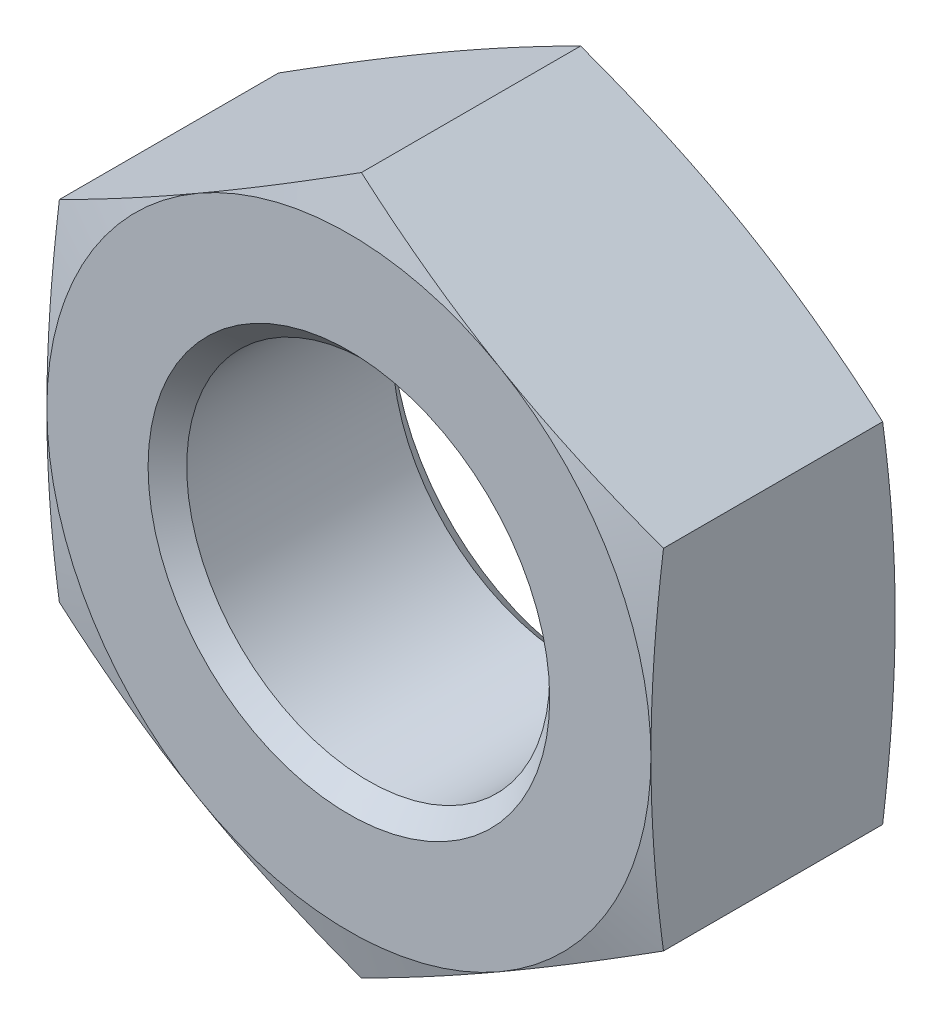
ISO-10303-21;
HEADER;
FILE_DESCRIPTION(('STEP AP214'),'2;1');
FILE_NAME('part.step','',(''),(''),'','','');
FILE_SCHEMA(('AUTOMOTIVE_DESIGN { 1 0 10303 214 1 1 1 1 }'));
ENDSEC;
DATA;
#1=APPLICATION_CONTEXT('core data for automotive mechanical design processes');
#2=APPLICATION_PROTOCOL_DEFINITION('international standard','automotive_design',2000,#1);
#3=PRODUCT_CONTEXT('',#1,'mechanical');
#4=PRODUCT('Part','Part','',(#3));
#5=PRODUCT_RELATED_PRODUCT_CATEGORY('part','',(#4));
#6=PRODUCT_DEFINITION_FORMATION('','',#4);
#7=PRODUCT_DEFINITION_CONTEXT('part definition',#1,'design');
#8=PRODUCT_DEFINITION('design','',#6,#7);
#9=PRODUCT_DEFINITION_SHAPE('','',#8);
#10=(LENGTH_UNIT() NAMED_UNIT(*) SI_UNIT(.MILLI.,.METRE.));
#11=(NAMED_UNIT(*) PLANE_ANGLE_UNIT() SI_UNIT($,.RADIAN.));
#12=(NAMED_UNIT(*) SI_UNIT($,.STERADIAN.) SOLID_ANGLE_UNIT());
#13=UNCERTAINTY_MEASURE_WITH_UNIT(LENGTH_MEASURE(1.E-05),#10,'distance_accuracy_value','');
#14=(GEOMETRIC_REPRESENTATION_CONTEXT(3) GLOBAL_UNCERTAINTY_ASSIGNED_CONTEXT((#13)) GLOBAL_UNIT_ASSIGNED_CONTEXT((#10,
#11,#12)) REPRESENTATION_CONTEXT('',''));
#15=CARTESIAN_POINT('',(0.,0.,0.));
#16=DIRECTION('',(0.,0.,1.));
#17=DIRECTION('',(1.,0.,0.));
#18=AXIS2_PLACEMENT_3D('',#15,#16,#17);
#19=CARTESIAN_POINT('',(0.,0.,0.));
#20=DIRECTION('',(0.,0.,-1.));
#21=DIRECTION('',(-1.,0.,0.));
#22=AXIS2_PLACEMENT_3D('',#19,#20,#21);
#23=PLANE('',#22);
#24=CARTESIAN_POINT('',(0.,0.,0.));
#25=DIRECTION('',(0.,0.,1.));
#26=DIRECTION('',(1.,0.,0.));
#27=AXIS2_PLACEMENT_3D('',#24,#25,#26);
#28=CIRCLE('',#27,11.938);
#29=CARTESIAN_POINT('',(11.938,0.,0.));
#30=VERTEX_POINT('',#29);
#31=CARTESIAN_POINT('',(5.96900000000041,10.3386112703787,0.));
#32=VERTEX_POINT('',#31);
#33=EDGE_CURVE('E11',#30,#32,#28,.T.);
#34=ORIENTED_EDGE('',*,*,#33,.T.);
#35=CARTESIAN_POINT('',(-5.96900000000041,10.3386112703787,0.));
#36=VERTEX_POINT('',#35);
#37=EDGE_CURVE('E43',#32,#36,#28,.T.);
#38=ORIENTED_EDGE('',*,*,#37,.T.);
#39=CARTESIAN_POINT('',(-11.938,0.,0.));
#40=VERTEX_POINT('',#39);
#41=EDGE_CURVE('E328',#36,#40,#28,.T.);
#42=ORIENTED_EDGE('',*,*,#41,.T.);
#43=CARTESIAN_POINT('',(-5.96900000000041,-10.3386112703787,0.));
#44=VERTEX_POINT('',#43);
#45=EDGE_CURVE('E321',#40,#44,#28,.T.);
#46=ORIENTED_EDGE('',*,*,#45,.T.);
#47=CARTESIAN_POINT('',(5.96900000000041,-10.3386112703787,0.));
#48=VERTEX_POINT('',#47);
#49=EDGE_CURVE('E324',#44,#48,#28,.T.);
#50=ORIENTED_EDGE('',*,*,#49,.T.);
#51=EDGE_CURVE('E44',#48,#30,#28,.T.);
#52=ORIENTED_EDGE('',*,*,#51,.T.);
#53=EDGE_LOOP('',(#34,#38,#42,#46,#50,#52));
#54=FACE_BOUND('',#53,.T.);
#55=CARTESIAN_POINT('',(0.,0.,0.));
#56=DIRECTION('',(0.,0.,1.));
#57=DIRECTION('',(1.,0.,0.));
#58=AXIS2_PLACEMENT_3D('',#55,#56,#57);
#59=CIRCLE('',#58,7.9375);
#60=CARTESIAN_POINT('',(7.9375,0.,0.));
#61=VERTEX_POINT('',#60);
#62=EDGE_CURVE('E185',#61,#61,#59,.T.);
#63=ORIENTED_EDGE('',*,*,#62,.F.);
#64=EDGE_LOOP('',(#63));
#65=FACE_BOUND('',#64,.T.);
#66=ADVANCED_FACE('F36',(#54,#65),#23,.F.);
#67=CARTESIAN_POINT('',(0.,11.938,-9.652));
#68=DIRECTION('',(0.,0.,1.));
#69=DIRECTION('',(1.,0.,0.));
#70=AXIS2_PLACEMENT_3D('',#67,#68,#69);
#71=PLANE('',#70);
#72=CARTESIAN_POINT('',(0.,0.,-9.652));
#73=DIRECTION('',(0.,0.,1.));
#74=DIRECTION('',(1.,0.,0.));
#75=AXIS2_PLACEMENT_3D('',#72,#73,#74);
#76=CIRCLE('',#75,11.938);
#77=CARTESIAN_POINT('',(11.938,0.,-9.652));
#78=VERTEX_POINT('',#77);
#79=CARTESIAN_POINT('',(5.96900000000041,10.3386112703787,-9.652));
#80=VERTEX_POINT('',#79);
#81=EDGE_CURVE('E359',#78,#80,#76,.T.);
#82=ORIENTED_EDGE('',*,*,#81,.F.);
#83=CARTESIAN_POINT('',(5.96900000000041,-10.3386112703787,-9.652));
#84=VERTEX_POINT('',#83);
#85=EDGE_CURVE('E362',#84,#78,#76,.T.);
#86=ORIENTED_EDGE('',*,*,#85,.F.);
#87=CARTESIAN_POINT('',(-5.96900000000041,-10.3386112703787,-9.652));
#88=VERTEX_POINT('',#87);
#89=EDGE_CURVE('E363',#88,#84,#76,.T.);
#90=ORIENTED_EDGE('',*,*,#89,.F.);
#91=CARTESIAN_POINT('',(-11.938,0.,-9.652));
#92=VERTEX_POINT('',#91);
#93=EDGE_CURVE('E143',#92,#88,#76,.T.);
#94=ORIENTED_EDGE('',*,*,#93,.F.);
#95=CARTESIAN_POINT('',(-5.96900000000041,10.3386112703787,-9.652));
#96=VERTEX_POINT('',#95);
#97=EDGE_CURVE('E360',#96,#92,#76,.T.);
#98=ORIENTED_EDGE('',*,*,#97,.F.);
#99=EDGE_CURVE('E356',#80,#96,#76,.T.);
#100=ORIENTED_EDGE('',*,*,#99,.F.);
#101=EDGE_LOOP('',(#82,#86,#90,#94,#98,#100));
#102=FACE_BOUND('',#101,.T.);
#103=CARTESIAN_POINT('',(0.,0.,-9.652));
#104=DIRECTION('',(0.,0.,1.));
#105=DIRECTION('',(1.,0.,0.));
#106=AXIS2_PLACEMENT_3D('',#103,#104,#105);
#107=CIRCLE('',#106,7.9375);
#108=CARTESIAN_POINT('',(7.9375,0.,-9.652));
#109=VERTEX_POINT('',#108);
#110=EDGE_CURVE('E205',#109,#109,#107,.T.);
#111=ORIENTED_EDGE('',*,*,#110,.T.);
#112=EDGE_LOOP('',(#111));
#113=FACE_BOUND('',#112,.T.);
#114=ADVANCED_FACE('F209',(#102,#113),#71,.F.);
#115=CARTESIAN_POINT('',(0.,0.,-0.63975549184855));
#116=DIRECTION('',(0.,0.,-1.));
#117=DIRECTION('',(-1.,0.,0.));
#118=AXIS2_PLACEMENT_3D('',#115,#116,#117);
#119=CONICAL_SURFACE('',#118,14.3256,1.30899693899575);
#120=CARTESIAN_POINT('',(-11.9382,6.89229204353196,-0.494883535596708));
#121=CARTESIAN_POINT('',(-11.4424282503734,7.17852599663549,-0.418156428695628));
#122=CARTESIAN_POINT('',(-10.9457576324378,7.46527891159921,-0.348500973257632));
#123=CARTESIAN_POINT('',(-9.95066243157995,8.03979739368385,-0.226122985982727));
#124=CARTESIAN_POINT('',(-9.45223721913185,8.32756332426167,-0.173407331405743));
#125=CARTESIAN_POINT('',(-8.45665466565767,8.90236317951052,-0.087986345206741));
#126=CARTESIAN_POINT('',(-7.9595040562106,9.18939321770259,-0.0551791492139855));
#127=CARTESIAN_POINT('',(-6.96456887030814,9.76381931510964,-0.0111880682381305));
#128=CARTESIAN_POINT('',(-6.46678443515407,10.0512152927443,0.));
#129=CARTESIAN_POINT('',(-5.47121556484592,10.6260072480135,0.));
#130=CARTESIAN_POINT('',(-4.97343112969185,10.9134032256482,-0.0111880682381549));
#131=CARTESIAN_POINT('',(-3.97849594378939,11.4878293230552,-0.0551791492140338));
#132=CARTESIAN_POINT('',(-3.48134533434232,11.7748593612473,-0.087986345206801));
#133=CARTESIAN_POINT('',(-2.48576278086814,12.3496592164961,-0.173407331405825));
#134=CARTESIAN_POINT('',(-1.98733756842005,12.637425147074,-0.226122985982818));
#135=CARTESIAN_POINT('',(-0.992242367562172,13.2119436291586,-0.348500973257741));
#136=CARTESIAN_POINT('',(-0.495571749626556,13.4986965441223,-0.418156428695746));
#137=CARTESIAN_POINT('',(0.000199999999999873,13.7849304972258,-0.494883535596833));
#138=B_SPLINE_CURVE_WITH_KNOTS('',3,(#120,#121,#122,#123,#124,#125,#126,#127,#128,#129,#130,
#131,#132,#133,#134,#135,#136,#137),.UNSPECIFIED.,.F.,.F.,(4,2,2,2,2,2,2,2,4),(0.,
1.73285128625863,3.46640519332185,5.19101265399724,6.91528637338862,8.63956009277999,
10.3641675534554,12.0977214605186,13.8305727467772),.UNSPECIFIED.);
#139=CARTESIAN_POINT('',(-11.938,6.8924075135858,-0.494852595100275));
#140=VERTEX_POINT('',#139);
#141=EDGE_CURVE('E336',#140,#36,#138,.T.);
#142=ORIENTED_EDGE('',*,*,#141,.F.);
#143=CARTESIAN_POINT('',(-11.938,-18.2329624239488,-2.64077400679266));
#144=CARTESIAN_POINT('',(-11.938,-17.6913696744449,-2.51939633949655));
#145=CARTESIAN_POINT('',(-11.938,-17.1494381756858,-2.39950312660577));
#146=CARTESIAN_POINT('',(-11.938,-16.0647313152317,-2.16348688179615));
#147=CARTESIAN_POINT('',(-11.938,-15.5219559181492,-2.04736401270748));
#148=CARTESIAN_POINT('',(-11.938,-14.434908682187,-1.81958867359742));
#149=CARTESIAN_POINT('',(-11.938,-13.890635897666,-1.70794070054803));
#150=CARTESIAN_POINT('',(-11.938,-12.8009574769211,-1.49032027214938));
#151=CARTESIAN_POINT('',(-11.938,-12.2555518502985,-1.38434776889991));
#152=CARTESIAN_POINT('',(-11.938,-11.1677674045129,-1.180247795952));
#153=CARTESIAN_POINT('',(-11.938,-10.6253991053055,-1.08206453394043));
#154=CARTESIAN_POINT('',(-11.938,-9.53916914199247,-0.894267340335431));
#155=CARTESIAN_POINT('',(-11.938,-8.99530747234857,-0.804653440566647));
#156=CARTESIAN_POINT('',(-11.938,-7.90600608674276,-0.636016702342263));
#157=CARTESIAN_POINT('',(-11.938,-7.36056659561774,-0.556992424159846));
#158=CARTESIAN_POINT('',(-11.938,-6.26795191717734,-0.41186228925882));
#159=CARTESIAN_POINT('',(-11.938,-5.72077672823634,-0.345756444642916));
#160=CARTESIAN_POINT('',(-11.938,-4.61851750236025,-0.22833505716445));
#161=CARTESIAN_POINT('',(-11.938,-4.06341433526461,-0.177196428128624));
#162=CARTESIAN_POINT('',(-11.938,-2.95181246319246,-0.093237299613816));
#163=CARTESIAN_POINT('',(-11.938,-2.39531379051455,-0.0604163800361554));
#164=CARTESIAN_POINT('',(-11.938,-1.28172815967689,-0.0150069189123938));
#165=CARTESIAN_POINT('',(-11.938,-0.724641584147543,-0.00240918301811301));
#166=CARTESIAN_POINT('',(-11.938,0.389611681402445,0.00177937722295485));
#167=CARTESIAN_POINT('',(-11.938,0.946778371353608,-0.00662978032144065));
#168=CARTESIAN_POINT('',(-11.938,2.06243645780666,-0.043982106061553));
#169=CARTESIAN_POINT('',(-11.938,2.62092530818588,-0.0729998002341817));
#170=CARTESIAN_POINT('',(-11.938,3.73658957414119,-0.149912821281346));
#171=CARTESIAN_POINT('',(-11.938,4.29376496036378,-0.197808566096605));
#172=CARTESIAN_POINT('',(-11.938,5.40679760797117,-0.310058338560213));
#173=CARTESIAN_POINT('',(-11.938,5.96265376929824,-0.374423106966597));
#174=CARTESIAN_POINT('',(-11.938,7.07257721361171,-0.516932618400637));
#175=CARTESIAN_POINT('',(-11.938,7.6266444909761,-0.595077404692646));
#176=CARTESIAN_POINT('',(-11.938,8.69641690113728,-0.757099427124152));
#177=CARTESIAN_POINT('',(-11.938,9.2122325547304,-0.840254303029304));
#178=CARTESIAN_POINT('',(-11.938,10.2425044503579,-1.01463514239579));
#179=CARTESIAN_POINT('',(-11.938,10.756960654909,-1.10586132605987));
#180=CARTESIAN_POINT('',(-11.938,11.7847069043095,-1.294911442235));
#181=CARTESIAN_POINT('',(-11.938,12.2979968264722,-1.39273603840907));
#182=CARTESIAN_POINT('',(-11.938,13.3235130283692,-1.59376697507529));
#183=CARTESIAN_POINT('',(-11.938,13.8357393176846,-1.69697326686994));
#184=CARTESIAN_POINT('',(-11.938,14.8594024070828,-1.90782005277345));
#185=CARTESIAN_POINT('',(-11.938,15.3708389914757,-2.01546159118339));
#186=CARTESIAN_POINT('',(-11.938,16.3929337232113,-2.23438433972006));
#187=CARTESIAN_POINT('',(-11.938,16.9035918660093,-2.34566557101054));
#188=CARTESIAN_POINT('',(-11.938,18.4345039483056,-2.68398646998532));
#189=CARTESIAN_POINT('',(-11.938,19.4537648727735,-2.91551781315897));
#190=CARTESIAN_POINT('',(-11.938,21.4803337058259,-3.38462009781527));
#191=CARTESIAN_POINT('',(-11.938,22.4876606512493,-3.62210933510761));
#192=CARTESIAN_POINT('',(-11.938,24.5009106019141,-4.10303560183728));
#193=CARTESIAN_POINT('',(-11.938,25.5068335812256,-4.34647273962938));
#194=CARTESIAN_POINT('',(-11.938,27.5163606552524,-4.83744827983636));
#195=CARTESIAN_POINT('',(-11.938,28.5199660796916,-5.08498125046663));
#196=CARTESIAN_POINT('',(-11.938,30.0247344667876,-5.45878236337262));
#197=CARTESIAN_POINT('',(-11.938,30.5262092376269,-5.58379764478769));
#198=CARTESIAN_POINT('',(-11.938,31.5289734668439,-5.83456702953237));
#199=CARTESIAN_POINT('',(-11.938,32.0302629254207,-5.96032113206533));
#200=CARTESIAN_POINT('',(-11.938,32.531471539357,-6.08639660660485));
#201=B_SPLINE_CURVE_WITH_KNOTS('',3,(#143,#144,#145,#146,#147,#148,#149,#150,#151,#152,#153,
#154,#155,#156,#157,#158,#159,#160,#161,#162,#163,#164,#165,#166,#167,#168,#169,#170,#171,#172,
#173,#174,#175,#176,#177,#178,#179,#180,#181,#182,#183,#184,#185,#186,#187,#188,#189,#190,#191,
#192,#193,#194,#195,#196,#197,#198,#199,#200),.UNSPECIFIED.,.F.,.F.,(4,2,2,2,2,2,2,2,2,2,2,2,2,
2,2,2,2,2,2,2,2,2,2,2,2,2,2,2,4),(0.,1.66508851645697,3.33024884784672,4.9970426158881,
6.66382231419357,8.31731808575057,9.97081999777277,11.6240968770559,13.2773753052131,
14.9494720185747,16.6215303824642,18.2928283396122,19.9641248560321,21.6414962055085,
23.3189046923561,24.9974099513293,26.6759204803055,28.243271107013,29.81066450763,
31.378215791163,32.9457528928094,34.5136612119763,36.0815786496928,39.2172010652111,
42.3220114684657,45.4268784752617,48.5279139911852,50.0783818372318,51.6288480117816),.UNSPECIFIED.);
#202=EDGE_CURVE('E154',#40,#140,#201,.T.);
#203=ORIENTED_EDGE('',*,*,#202,.F.);
#204=ORIENTED_EDGE('',*,*,#41,.F.);
#205=EDGE_LOOP('',(#142,#203,#204));
#206=FACE_BOUND('',#205,.T.);
#207=ADVANCED_FACE('F227',(#206),#119,.T.);
#208=CARTESIAN_POINT('',(0.,13.784815027172,-0.494852595100401));
#209=VERTEX_POINT('',#208);
#210=EDGE_CURVE('E333',#36,#209,#138,.T.);
#211=ORIENTED_EDGE('',*,*,#210,.F.);
#212=ORIENTED_EDGE('',*,*,#37,.F.);
#213=CARTESIAN_POINT('',(-0.0002,13.7849304972258,-0.494883535596833));
#214=CARTESIAN_POINT('',(0.495571749626556,13.4986965441223,-0.418156428695746));
#215=CARTESIAN_POINT('',(0.992242367562172,13.2119436291586,-0.348500973257741));
#216=CARTESIAN_POINT('',(1.98733756842005,12.637425147074,-0.226122985982818));
#217=CARTESIAN_POINT('',(2.48576278086814,12.3496592164961,-0.173407331405825));
#218=CARTESIAN_POINT('',(3.48134533434232,11.7748593612473,-0.0879863452068009));
#219=CARTESIAN_POINT('',(3.97849594378939,11.4878293230552,-0.0551791492140337));
#220=CARTESIAN_POINT('',(4.97343112969185,10.9134032256482,-0.0111880682381548));
#221=CARTESIAN_POINT('',(5.47121556484592,10.6260072480135,0.));
#222=CARTESIAN_POINT('',(6.46678443515407,10.0512152927443,0.));
#223=CARTESIAN_POINT('',(6.96456887030814,9.76381931510964,-0.0111880682381303));
#224=CARTESIAN_POINT('',(7.9595040562106,9.1893932177026,-0.0551791492139853));
#225=CARTESIAN_POINT('',(8.45665466565767,8.90236317951052,-0.087986345206741));
#226=CARTESIAN_POINT('',(9.45223721913186,8.32756332426167,-0.173407331405743));
#227=CARTESIAN_POINT('',(9.95066243157995,8.03979739368385,-0.226122985982727));
#228=CARTESIAN_POINT('',(10.9457576324378,7.46527891159921,-0.348500973257631));
#229=CARTESIAN_POINT('',(11.4424282503734,7.17852599663549,-0.418156428695627));
#230=CARTESIAN_POINT('',(11.9382,6.89229204353196,-0.494883535596707));
#231=B_SPLINE_CURVE_WITH_KNOTS('',3,(#213,#214,#215,#216,#217,#218,#219,#220,#221,#222,#223,
#224,#225,#226,#227,#228,#229,#230),.UNSPECIFIED.,.F.,.F.,(4,2,2,2,2,2,2,2,4),(0.,
1.73285128625862,3.46640519332184,5.19101265399724,6.91528637338861,8.63956009277998,
10.3641675534554,12.0977214605186,13.8305727467772),.UNSPECIFIED.);
#232=EDGE_CURVE('E266',#209,#32,#231,.T.);
#233=ORIENTED_EDGE('',*,*,#232,.F.);
#234=EDGE_LOOP('',(#211,#212,#233));
#235=FACE_BOUND('',#234,.T.);
#236=ADVANCED_FACE('F275',(#235),#119,.T.);
#237=CARTESIAN_POINT('',(11.938,6.8924075135858,-0.494852595100275));
#238=VERTEX_POINT('',#237);
#239=EDGE_CURVE('E261',#32,#238,#231,.T.);
#240=ORIENTED_EDGE('',*,*,#239,.F.);
#241=ORIENTED_EDGE('',*,*,#33,.F.);
#242=CARTESIAN_POINT('',(11.938,-18.2329624239488,-2.64077400679266));
#243=CARTESIAN_POINT('',(11.938,-17.6913696744449,-2.51939633949655));
#244=CARTESIAN_POINT('',(11.938,-17.1494381756858,-2.39950312660577));
#245=CARTESIAN_POINT('',(11.938,-16.0647313152317,-2.16348688179615));
#246=CARTESIAN_POINT('',(11.938,-15.5219559181492,-2.04736401270748));
#247=CARTESIAN_POINT('',(11.938,-14.434908682187,-1.81958867359742));
#248=CARTESIAN_POINT('',(11.938,-13.890635897666,-1.70794070054803));
#249=CARTESIAN_POINT('',(11.938,-12.8009574769211,-1.49032027214938));
#250=CARTESIAN_POINT('',(11.938,-12.2555518502985,-1.38434776889991));
#251=CARTESIAN_POINT('',(11.938,-11.1677674045129,-1.180247795952));
#252=CARTESIAN_POINT('',(11.938,-10.6253991053055,-1.08206453394043));
#253=CARTESIAN_POINT('',(11.938,-9.53916914199247,-0.894267340335431));
#254=CARTESIAN_POINT('',(11.938,-8.99530747234857,-0.804653440566647));
#255=CARTESIAN_POINT('',(11.938,-7.90600608674276,-0.636016702342263));
#256=CARTESIAN_POINT('',(11.938,-7.36056659561774,-0.556992424159846));
#257=CARTESIAN_POINT('',(11.938,-6.26795191717734,-0.41186228925882));
#258=CARTESIAN_POINT('',(11.938,-5.72077672823634,-0.345756444642916));
#259=CARTESIAN_POINT('',(11.938,-4.61851750236025,-0.22833505716445));
#260=CARTESIAN_POINT('',(11.938,-4.06341433526461,-0.177196428128624));
#261=CARTESIAN_POINT('',(11.938,-2.95181246319246,-0.093237299613816));
#262=CARTESIAN_POINT('',(11.938,-2.39531379051455,-0.0604163800361554));
#263=CARTESIAN_POINT('',(11.938,-1.28172815967689,-0.0150069189123938));
#264=CARTESIAN_POINT('',(11.938,-0.724641584147543,-0.00240918301811301));
#265=CARTESIAN_POINT('',(11.938,0.389611681402445,0.00177937722295485));
#266=CARTESIAN_POINT('',(11.938,0.946778371353608,-0.00662978032144065));
#267=CARTESIAN_POINT('',(11.938,2.06243645780666,-0.043982106061553));
#268=CARTESIAN_POINT('',(11.938,2.62092530818588,-0.0729998002341817));
#269=CARTESIAN_POINT('',(11.938,3.73658957414119,-0.149912821281346));
#270=CARTESIAN_POINT('',(11.938,4.29376496036378,-0.197808566096605));
#271=CARTESIAN_POINT('',(11.938,5.40679760797117,-0.310058338560213));
#272=CARTESIAN_POINT('',(11.938,5.96265376929824,-0.374423106966597));
#273=CARTESIAN_POINT('',(11.938,7.07257721361171,-0.516932618400637));
#274=CARTESIAN_POINT('',(11.938,7.6266444909761,-0.595077404692646));
#275=CARTESIAN_POINT('',(11.938,8.69641690113728,-0.757099427124152));
#276=CARTESIAN_POINT('',(11.938,9.2122325547304,-0.840254303029304));
#277=CARTESIAN_POINT('',(11.938,10.2425044503579,-1.01463514239579));
#278=CARTESIAN_POINT('',(11.938,10.756960654909,-1.10586132605987));
#279=CARTESIAN_POINT('',(11.938,11.7847069043095,-1.294911442235));
#280=CARTESIAN_POINT('',(11.938,12.2979968264722,-1.39273603840907));
#281=CARTESIAN_POINT('',(11.938,13.3235130283692,-1.59376697507529));
#282=CARTESIAN_POINT('',(11.938,13.8357393176846,-1.69697326686994));
#283=CARTESIAN_POINT('',(11.938,14.8594024070828,-1.90782005277345));
#284=CARTESIAN_POINT('',(11.938,15.3708389914757,-2.01546159118339));
#285=CARTESIAN_POINT('',(11.938,16.3929337232113,-2.23438433972006));
#286=CARTESIAN_POINT('',(11.938,16.9035918660093,-2.34566557101054));
#287=CARTESIAN_POINT('',(11.938,18.4345039483056,-2.68398646998532));
#288=CARTESIAN_POINT('',(11.938,19.4537648727735,-2.91551781315897));
#289=CARTESIAN_POINT('',(11.938,21.4803337058259,-3.38462009781527));
#290=CARTESIAN_POINT('',(11.938,22.4876606512493,-3.62210933510761));
#291=CARTESIAN_POINT('',(11.938,24.5009106019141,-4.10303560183728));
#292=CARTESIAN_POINT('',(11.938,25.5068335812256,-4.34647273962938));
#293=CARTESIAN_POINT('',(11.938,27.5163606552524,-4.83744827983636));
#294=CARTESIAN_POINT('',(11.938,28.5199660796916,-5.08498125046663));
#295=CARTESIAN_POINT('',(11.938,30.0247344667876,-5.45878236337262));
#296=CARTESIAN_POINT('',(11.938,30.5262092376269,-5.58379764478769));
#297=CARTESIAN_POINT('',(11.938,31.5289734668439,-5.83456702953237));
#298=CARTESIAN_POINT('',(11.938,32.0302629254207,-5.96032113206533));
#299=CARTESIAN_POINT('',(11.938,32.531471539357,-6.08639660660485));
#300=B_SPLINE_CURVE_WITH_KNOTS('',3,(#242,#243,#244,#245,#246,#247,#248,#249,#250,#251,#252,
#253,#254,#255,#256,#257,#258,#259,#260,#261,#262,#263,#264,#265,#266,#267,#268,#269,#270,#271,
#272,#273,#274,#275,#276,#277,#278,#279,#280,#281,#282,#283,#284,#285,#286,#287,#288,#289,#290,
#291,#292,#293,#294,#295,#296,#297,#298,#299),.UNSPECIFIED.,.F.,.F.,(4,2,2,2,2,2,2,2,2,2,2,2,2,
2,2,2,2,2,2,2,2,2,2,2,2,2,2,2,4),(0.,1.66508851645697,3.33024884784672,4.9970426158881,
6.66382231419357,8.31731808575057,9.97081999777277,11.6240968770559,13.2773753052131,
14.9494720185747,16.6215303824642,18.2928283396122,19.9641248560321,21.6414962055085,
23.3189046923561,24.9974099513293,26.6759204803055,28.243271107013,29.81066450763,
31.378215791163,32.9457528928094,34.5136612119763,36.0815786496928,39.2172010652111,
42.3220114684657,45.4268784752617,48.5279139911852,50.0783818372318,51.6288480117816),.UNSPECIFIED.);
#301=EDGE_CURVE('E293',#238,#30,#300,.F.);
#302=ORIENTED_EDGE('',*,*,#301,.F.);
#303=EDGE_LOOP('',(#240,#241,#302));
#304=FACE_BOUND('',#303,.T.);
#305=ADVANCED_FACE('F347',(#304),#119,.T.);
#306=CARTESIAN_POINT('',(11.938,-6.8924075135858,-0.494852595100275));
#307=VERTEX_POINT('',#306);
#308=EDGE_CURVE('E289',#30,#307,#300,.F.);
#309=ORIENTED_EDGE('',*,*,#308,.F.);
#310=ORIENTED_EDGE('',*,*,#51,.F.);
#311=CARTESIAN_POINT('',(11.9382,-6.89229204353196,-0.494883535596708));
#312=CARTESIAN_POINT('',(11.4424282503734,-7.17852599663549,-0.418156428695628));
#313=CARTESIAN_POINT('',(10.9457576324378,-7.46527891159921,-0.348500973257632));
#314=CARTESIAN_POINT('',(9.95066243157995,-8.03979739368385,-0.226122985982727));
#315=CARTESIAN_POINT('',(9.45223721913185,-8.32756332426167,-0.173407331405743));
#316=CARTESIAN_POINT('',(8.45665466565767,-8.90236317951052,-0.087986345206741));
#317=CARTESIAN_POINT('',(7.9595040562106,-9.18939321770259,-0.0551791492139855));
#318=CARTESIAN_POINT('',(6.96456887030814,-9.76381931510964,-0.0111880682381305));
#319=CARTESIAN_POINT('',(6.46678443515407,-10.0512152927443,0.));
#320=CARTESIAN_POINT('',(5.47121556484592,-10.6260072480135,0.));
#321=CARTESIAN_POINT('',(4.97343112969185,-10.9134032256482,-0.0111880682381549));
#322=CARTESIAN_POINT('',(3.97849594378939,-11.4878293230552,-0.0551791492140338));
#323=CARTESIAN_POINT('',(3.48134533434232,-11.7748593612473,-0.087986345206801));
#324=CARTESIAN_POINT('',(2.48576278086814,-12.3496592164961,-0.173407331405825));
#325=CARTESIAN_POINT('',(1.98733756842005,-12.637425147074,-0.226122985982818));
#326=CARTESIAN_POINT('',(0.992242367562172,-13.2119436291586,-0.348500973257741));
#327=CARTESIAN_POINT('',(0.495571749626556,-13.4986965441223,-0.418156428695746));
#328=CARTESIAN_POINT('',(-0.000199999999999873,-13.7849304972258,-0.494883535596833));
#329=B_SPLINE_CURVE_WITH_KNOTS('',3,(#311,#312,#313,#314,#315,#316,#317,#318,#319,#320,#321,
#322,#323,#324,#325,#326,#327,#328),.UNSPECIFIED.,.F.,.F.,(4,2,2,2,2,2,2,2,4),(0.,
1.73285128625863,3.46640519332185,5.19101265399724,6.91528637338862,8.63956009277999,
10.3641675534554,12.0977214605186,13.8305727467772),.UNSPECIFIED.);
#330=EDGE_CURVE('E299',#307,#48,#329,.T.);
#331=ORIENTED_EDGE('',*,*,#330,.F.);
#332=EDGE_LOOP('',(#309,#310,#331));
#333=FACE_BOUND('',#332,.T.);
#334=ADVANCED_FACE('F387',(#333),#119,.T.);
#335=CARTESIAN_POINT('',(0.,-13.784815027172,-0.494852595100401));
#336=VERTEX_POINT('',#335);
#337=EDGE_CURVE('E284',#48,#336,#329,.T.);
#338=ORIENTED_EDGE('',*,*,#337,.F.);
#339=ORIENTED_EDGE('',*,*,#49,.F.);
#340=CARTESIAN_POINT('',(0.0002,-13.7849304972258,-0.494883535596833));
#341=CARTESIAN_POINT('',(-0.495571749626556,-13.4986965441223,-0.418156428695746));
#342=CARTESIAN_POINT('',(-0.992242367562172,-13.2119436291586,-0.348500973257741));
#343=CARTESIAN_POINT('',(-1.98733756842005,-12.637425147074,-0.226122985982818));
#344=CARTESIAN_POINT('',(-2.48576278086814,-12.3496592164961,-0.173407331405825));
#345=CARTESIAN_POINT('',(-3.48134533434232,-11.7748593612473,-0.0879863452068009));
#346=CARTESIAN_POINT('',(-3.97849594378939,-11.4878293230552,-0.0551791492140337));
#347=CARTESIAN_POINT('',(-4.97343112969185,-10.9134032256482,-0.0111880682381548));
#348=CARTESIAN_POINT('',(-5.47121556484592,-10.6260072480135,0.));
#349=CARTESIAN_POINT('',(-6.46678443515407,-10.0512152927443,0.));
#350=CARTESIAN_POINT('',(-6.96456887030814,-9.76381931510964,-0.0111880682381303));
#351=CARTESIAN_POINT('',(-7.9595040562106,-9.1893932177026,-0.0551791492139853));
#352=CARTESIAN_POINT('',(-8.45665466565767,-8.90236317951052,-0.087986345206741));
#353=CARTESIAN_POINT('',(-9.45223721913186,-8.32756332426167,-0.173407331405743));
#354=CARTESIAN_POINT('',(-9.95066243157995,-8.03979739368385,-0.226122985982727));
#355=CARTESIAN_POINT('',(-10.9457576324378,-7.46527891159921,-0.348500973257631));
#356=CARTESIAN_POINT('',(-11.4424282503734,-7.17852599663549,-0.418156428695627));
#357=CARTESIAN_POINT('',(-11.9382,-6.89229204353196,-0.494883535596707));
#358=B_SPLINE_CURVE_WITH_KNOTS('',3,(#340,#341,#342,#343,#344,#345,#346,#347,#348,#349,#350,
#351,#352,#353,#354,#355,#356,#357),.UNSPECIFIED.,.F.,.F.,(4,2,2,2,2,2,2,2,4),(0.,
1.73285128625862,3.46640519332184,5.19101265399724,6.91528637338861,8.63956009277998,
10.3641675534554,12.0977214605186,13.8305727467772),.UNSPECIFIED.);
#359=EDGE_CURVE('E146',#336,#44,#358,.T.);
#360=ORIENTED_EDGE('',*,*,#359,.F.);
#361=EDGE_LOOP('',(#338,#339,#360));
#362=FACE_BOUND('',#361,.T.);
#363=ADVANCED_FACE('F325',(#362),#119,.T.);
#364=CARTESIAN_POINT('',(-11.938,-6.8924075135858,-0.494852595100275));
#365=VERTEX_POINT('',#364);
#366=EDGE_CURVE('E138',#44,#365,#358,.T.);
#367=ORIENTED_EDGE('',*,*,#366,.F.);
#368=ORIENTED_EDGE('',*,*,#45,.F.);
#369=EDGE_CURVE('E51',#365,#40,#201,.T.);
#370=ORIENTED_EDGE('',*,*,#369,.F.);
#371=EDGE_LOOP('',(#367,#368,#370));
#372=FACE_BOUND('',#371,.T.);
#373=ADVANCED_FACE('F277',(#372),#119,.T.);
#374=CARTESIAN_POINT('',(0.,13.784815027172,-9.652));
#375=DIRECTION('',(-0.500000000000024,0.866025403784425,0.));
#376=DIRECTION('',(-0.866025403784425,-0.500000000000024,0.));
#377=AXIS2_PLACEMENT_3D('',#374,#375,#376);
#378=PLANE('',#377);
#379=ORIENTED_EDGE('',*,*,#141,.T.);
#380=ORIENTED_EDGE('',*,*,#210,.T.);
#381=DIRECTION('',(0.,0.,1.));
#382=VECTOR('',#381,1.);
#383=CARTESIAN_POINT('',(0.,13.784815027172,-9.652));
#384=LINE('',#383,#382);
#385=CARTESIAN_POINT('',(0.,13.784815027172,-9.15714740489964));
#386=VERTEX_POINT('',#385);
#387=EDGE_CURVE('E131',#386,#209,#384,.T.);
#388=ORIENTED_EDGE('',*,*,#387,.F.);
#389=CARTESIAN_POINT('',(0.0002,13.7849304972258,-9.15711646440321));
#390=CARTESIAN_POINT('',(-0.495571749626558,13.4986965441223,-9.23384357130429));
#391=CARTESIAN_POINT('',(-0.992242367562173,13.2119436291586,-9.30349902674229));
#392=CARTESIAN_POINT('',(-1.98733756842005,12.637425147074,-9.4258770140172));
#393=CARTESIAN_POINT('',(-2.48576278086814,12.3496592164961,-9.47859266859419));
#394=CARTESIAN_POINT('',(-3.48134533434232,11.7748593612473,-9.56401365479321));
#395=CARTESIAN_POINT('',(-3.9784959437894,11.4878293230552,-9.59682085078597));
#396=CARTESIAN_POINT('',(-4.97343112969185,10.9134032256482,-9.64081193176185));
#397=CARTESIAN_POINT('',(-5.47121556484592,10.6260072480135,-9.65199999999993));
#398=CARTESIAN_POINT('',(-6.46678443515407,10.0512152927443,-9.65199999999994));
#399=CARTESIAN_POINT('',(-6.96456887030814,9.76381931510964,-9.64081193176187));
#400=CARTESIAN_POINT('',(-7.9595040562106,9.1893932177026,-9.59682085078602));
#401=CARTESIAN_POINT('',(-8.45665466565767,8.90236317951052,-9.56401365479326));
#402=CARTESIAN_POINT('',(-9.45223721913186,8.32756332426167,-9.47859266859427));
#403=CARTESIAN_POINT('',(-9.95066243157995,8.03979739368385,-9.42587701401729));
#404=CARTESIAN_POINT('',(-10.9457576324378,7.46527891159921,-9.3034990267424));
#405=CARTESIAN_POINT('',(-11.4424282503734,7.17852599663549,-9.2338435713044));
#406=CARTESIAN_POINT('',(-11.9382,6.89229204353196,-9.15711646440333));
#407=B_SPLINE_CURVE_WITH_KNOTS('',3,(#389,#390,#391,#392,#393,#394,#395,#396,#397,#398,#399,
#400,#401,#402,#403,#404,#405,#406),.UNSPECIFIED.,.F.,.F.,(4,2,2,2,2,2,2,2,4),(0.,
1.73285128625862,3.46640519332184,5.19101265399724,6.91528637338861,8.63956009277998,
10.3641675534554,12.0977214605186,13.8305727467772),.UNSPECIFIED.);
#408=EDGE_CURVE('E337',#386,#96,#407,.T.);
#409=ORIENTED_EDGE('',*,*,#408,.T.);
#410=CARTESIAN_POINT('',(-11.938,6.8924075135858,-9.15714740489976));
#411=VERTEX_POINT('',#410);
#412=EDGE_CURVE('E268',#96,#411,#407,.T.);
#413=ORIENTED_EDGE('',*,*,#412,.T.);
#414=DIRECTION('',(0.,0.,1.));
#415=VECTOR('',#414,1.);
#416=CARTESIAN_POINT('',(-11.938,6.8924075135858,-9.652));
#417=LINE('',#416,#415);
#418=EDGE_CURVE('E140',#411,#140,#417,.T.);
#419=ORIENTED_EDGE('',*,*,#418,.T.);
#420=EDGE_LOOP('',(#379,#380,#388,#409,#413,#419));
#421=FACE_BOUND('',#420,.T.);
#422=ADVANCED_FACE('F177',(#421),#378,.T.);
#423=CARTESIAN_POINT('',(11.938,6.8924075135858,-9.652));
#424=DIRECTION('',(0.500000000000024,0.866025403784425,0.));
#425=DIRECTION('',(-0.866025403784425,0.500000000000024,0.));
#426=AXIS2_PLACEMENT_3D('',#423,#424,#425);
#427=PLANE('',#426);
#428=ORIENTED_EDGE('',*,*,#232,.T.);
#429=ORIENTED_EDGE('',*,*,#239,.T.);
#430=DIRECTION('',(0.,0.,1.));
#431=VECTOR('',#430,1.);
#432=CARTESIAN_POINT('',(11.938,6.8924075135858,-9.652));
#433=LINE('',#432,#431);
#434=CARTESIAN_POINT('',(11.938,6.8924075135858,-9.15714740489976));
#435=VERTEX_POINT('',#434);
#436=EDGE_CURVE('E192',#435,#238,#433,.T.);
#437=ORIENTED_EDGE('',*,*,#436,.F.);
#438=CARTESIAN_POINT('',(11.9382,6.89229204353196,-9.15711646440333));
#439=CARTESIAN_POINT('',(11.4424282503734,7.17852599663548,-9.2338435713044));
#440=CARTESIAN_POINT('',(10.9457576324378,7.46527891159921,-9.3034990267424));
#441=CARTESIAN_POINT('',(9.95066243157995,8.03979739368385,-9.42587701401729));
#442=CARTESIAN_POINT('',(9.45223721913185,8.32756332426167,-9.47859266859427));
#443=CARTESIAN_POINT('',(8.45665466565767,8.90236317951052,-9.56401365479326));
#444=CARTESIAN_POINT('',(7.9595040562106,9.1893932177026,-9.59682085078602));
#445=CARTESIAN_POINT('',(6.96456887030814,9.76381931510964,-9.64081193176187));
#446=CARTESIAN_POINT('',(6.46678443515407,10.0512152927443,-9.65199999999994));
#447=CARTESIAN_POINT('',(5.47121556484592,10.6260072480135,-9.65199999999993));
#448=CARTESIAN_POINT('',(4.97343112969185,10.9134032256482,-9.64081193176185));
#449=CARTESIAN_POINT('',(3.97849594378939,11.4878293230552,-9.59682085078597));
#450=CARTESIAN_POINT('',(3.48134533434232,11.7748593612473,-9.56401365479321));
#451=CARTESIAN_POINT('',(2.48576278086814,12.3496592164961,-9.47859266859419));
#452=CARTESIAN_POINT('',(1.98733756842004,12.637425147074,-9.4258770140172));
#453=CARTESIAN_POINT('',(0.992242367562171,13.2119436291586,-9.30349902674229));
#454=CARTESIAN_POINT('',(0.495571749626555,13.4986965441223,-9.23384357130429));
#455=CARTESIAN_POINT('',(-0.000200000000001992,13.7849304972258,-9.15711646440321));
#456=B_SPLINE_CURVE_WITH_KNOTS('',3,(#438,#439,#440,#441,#442,#443,#444,#445,#446,#447,#448,
#449,#450,#451,#452,#453,#454,#455),.UNSPECIFIED.,.F.,.F.,(4,2,2,2,2,2,2,2,4),(0.,
1.73285128625863,3.46640519332185,5.19101265399724,6.91528637338861,8.63956009277998,
10.3641675534554,12.0977214605186,13.8305727467772),.UNSPECIFIED.);
#457=EDGE_CURVE('E267',#435,#80,#456,.T.);
#458=ORIENTED_EDGE('',*,*,#457,.T.);
#459=EDGE_CURVE('E255',#80,#386,#456,.T.);
#460=ORIENTED_EDGE('',*,*,#459,.T.);
#461=ORIENTED_EDGE('',*,*,#387,.T.);
#462=EDGE_LOOP('',(#428,#429,#437,#458,#460,#461));
#463=FACE_BOUND('',#462,.T.);
#464=ADVANCED_FACE('F247',(#463),#427,.T.);
#465=CARTESIAN_POINT('',(11.938,-6.8924075135858,-9.652));
#466=DIRECTION('',(1.,0.,0.));
#467=DIRECTION('',(0.,0.,-1.));
#468=AXIS2_PLACEMENT_3D('',#465,#466,#467);
#469=PLANE('',#468);
#470=ORIENTED_EDGE('',*,*,#301,.T.);
#471=ORIENTED_EDGE('',*,*,#308,.T.);
#472=DIRECTION('',(0.,0.,1.));
#473=VECTOR('',#472,1.);
#474=CARTESIAN_POINT('',(11.938,-6.8924075135858,-9.652));
#475=LINE('',#474,#473);
#476=CARTESIAN_POINT('',(11.938,-6.8924075135858,-9.15714740489976));
#477=VERTEX_POINT('',#476);
#478=EDGE_CURVE('E189',#477,#307,#475,.T.);
#479=ORIENTED_EDGE('',*,*,#478,.F.);
#480=CARTESIAN_POINT('',(11.938,-18.2329624239488,-7.01122599320756));
#481=CARTESIAN_POINT('',(11.938,-17.6913696744449,-7.13260366050366));
#482=CARTESIAN_POINT('',(11.938,-17.1494381756858,-7.25249687339443));
#483=CARTESIAN_POINT('',(11.938,-16.0647313152317,-7.48851311820403));
#484=CARTESIAN_POINT('',(11.938,-15.5219559181492,-7.60463598729269));
#485=CARTESIAN_POINT('',(11.938,-14.434908682187,-7.83241132640272));
#486=CARTESIAN_POINT('',(11.938,-13.890635897666,-7.94405929945211));
#487=CARTESIAN_POINT('',(11.938,-12.800957476921,-8.16167972785074));
#488=CARTESIAN_POINT('',(11.938,-12.2555518502984,-8.2676522311002));
#489=CARTESIAN_POINT('',(11.938,-11.1677674045129,-8.47175220404809));
#490=CARTESIAN_POINT('',(11.938,-10.6253991053055,-8.56993546605966));
#491=CARTESIAN_POINT('',(11.938,-9.53916914199246,-8.75773265966464));
#492=CARTESIAN_POINT('',(11.938,-8.99530747234856,-8.84734655943342));
#493=CARTESIAN_POINT('',(11.938,-7.90600608674275,-9.01598329765779));
#494=CARTESIAN_POINT('',(11.938,-7.36056659561774,-9.0950075758402));
#495=CARTESIAN_POINT('',(11.938,-6.26795191717734,-9.24013771074121));
#496=CARTESIAN_POINT('',(11.938,-5.72077672823634,-9.30624355535711));
#497=CARTESIAN_POINT('',(11.938,-4.61851750236025,-9.42366494283557));
#498=CARTESIAN_POINT('',(11.938,-4.0634143352646,-9.47480357187139));
#499=CARTESIAN_POINT('',(11.938,-2.95181246319246,-9.55876270038619));
#500=CARTESIAN_POINT('',(11.938,-2.39531379051455,-9.59158361996385));
#501=CARTESIAN_POINT('',(11.938,-1.2817281596769,-9.63699308108761));
#502=CARTESIAN_POINT('',(11.938,-0.724641584147557,-9.64959081698189));
#503=CARTESIAN_POINT('',(11.938,0.389611681402426,-9.65377937722295));
#504=CARTESIAN_POINT('',(11.938,0.946778371353587,-9.64537021967856));
#505=CARTESIAN_POINT('',(11.938,2.06243645780664,-9.60801789393845));
#506=CARTESIAN_POINT('',(11.938,2.62092530818585,-9.57900019976582));
#507=CARTESIAN_POINT('',(11.938,3.73658957414116,-9.50208717871867));
#508=CARTESIAN_POINT('',(11.938,4.29376496036374,-9.45419143390341));
#509=CARTESIAN_POINT('',(11.938,5.40679760797113,-9.34194166143982));
#510=CARTESIAN_POINT('',(11.938,5.9626537692982,-9.27757689303344));
#511=CARTESIAN_POINT('',(11.938,7.07257721361167,-9.13506738159941));
#512=CARTESIAN_POINT('',(11.938,7.62664449097604,-9.05692259530741));
#513=CARTESIAN_POINT('',(11.938,8.69641690113723,-8.89490057287592));
#514=CARTESIAN_POINT('',(11.938,9.21223255473035,-8.81174569697077));
#515=CARTESIAN_POINT('',(11.938,10.2425044503579,-8.6373648576043));
#516=CARTESIAN_POINT('',(11.938,10.756960654909,-8.54613867394023));
#517=CARTESIAN_POINT('',(11.938,11.7847069043094,-8.35708855776511));
#518=CARTESIAN_POINT('',(11.938,12.2979968264721,-8.25926396159105));
#519=CARTESIAN_POINT('',(11.938,13.3235130283692,-8.05823302492485));
#520=CARTESIAN_POINT('',(11.938,13.8357393176845,-7.9550267331302));
#521=CARTESIAN_POINT('',(11.938,14.8594024070828,-7.74417994722672));
#522=CARTESIAN_POINT('',(11.938,15.3708389914757,-7.63653840881679));
#523=CARTESIAN_POINT('',(11.938,16.3929337232112,-7.41761566028013));
#524=CARTESIAN_POINT('',(11.938,16.9035918660093,-7.30633442898966));
#525=CARTESIAN_POINT('',(11.938,18.4345039483056,-6.9680135300149));
#526=CARTESIAN_POINT('',(11.938,19.4537648727734,-6.73648218684127));
#527=CARTESIAN_POINT('',(11.938,21.4803337058259,-6.26737990218501));
#528=CARTESIAN_POINT('',(11.938,22.4876606512493,-6.02989066489269));
#529=CARTESIAN_POINT('',(11.938,24.5009106019141,-5.54896439816306));
#530=CARTESIAN_POINT('',(11.938,25.5068335812256,-5.30552726037097));
#531=CARTESIAN_POINT('',(11.938,27.5163606552524,-4.81455172016403));
#532=CARTESIAN_POINT('',(11.938,28.5199660796916,-4.56701874953378));
#533=CARTESIAN_POINT('',(11.938,30.0247344667876,-4.19321763662782));
#534=CARTESIAN_POINT('',(11.938,30.5262092376269,-4.06820235521276));
#535=CARTESIAN_POINT('',(11.938,31.5289734668439,-3.8174329704681));
#536=CARTESIAN_POINT('',(11.938,32.0302629254207,-3.69167886793515));
#537=CARTESIAN_POINT('',(11.938,32.531471539357,-3.56560339339564));
#538=B_SPLINE_CURVE_WITH_KNOTS('',3,(#480,#481,#482,#483,#484,#485,#486,#487,#488,#489,#490,
#491,#492,#493,#494,#495,#496,#497,#498,#499,#500,#501,#502,#503,#504,#505,#506,#507,#508,#509,
#510,#511,#512,#513,#514,#515,#516,#517,#518,#519,#520,#521,#522,#523,#524,#525,#526,#527,#528,
#529,#530,#531,#532,#533,#534,#535,#536,#537),.UNSPECIFIED.,.F.,.F.,(4,2,2,2,2,2,2,2,2,2,2,2,2,
2,2,2,2,2,2,2,2,2,2,2,2,2,2,2,4),(0.,1.66508851645697,3.33024884784671,4.99704261588808,
6.66382231419355,8.31731808575055,9.97081999777274,11.6240968770558,13.2773753052131,
14.9494720185747,16.6215303824642,18.2928283396121,19.9641248560321,21.6414962055084,
23.318904692356,24.9974099513292,26.6759204803054,28.2432711070129,29.8106645076299,
31.3782157911629,32.9457528928093,34.5136612119762,36.0815786496927,39.217201065211,
42.3220114684656,45.4268784752615,48.5279139911851,50.0783818372317,51.6288480117815),.UNSPECIFIED.);
#539=EDGE_CURVE('E294',#477,#78,#538,.T.);
#540=ORIENTED_EDGE('',*,*,#539,.T.);
#541=EDGE_CURVE('E295',#78,#435,#538,.T.);
#542=ORIENTED_EDGE('',*,*,#541,.T.);
#543=ORIENTED_EDGE('',*,*,#436,.T.);
#544=EDGE_LOOP('',(#470,#471,#479,#540,#542,#543));
#545=FACE_BOUND('',#544,.T.);
#546=ADVANCED_FACE('F250',(#545),#469,.T.);
#547=CARTESIAN_POINT('',(0.,-13.784815027172,-9.652));
#548=DIRECTION('',(0.500000000000024,-0.866025403784425,0.));
#549=DIRECTION('',(0.866025403784425,0.500000000000024,0.));
#550=AXIS2_PLACEMENT_3D('',#547,#548,#549);
#551=PLANE('',#550);
#552=ORIENTED_EDGE('',*,*,#330,.T.);
#553=ORIENTED_EDGE('',*,*,#337,.T.);
#554=DIRECTION('',(0.,0.,1.));
#555=VECTOR('',#554,1.);
#556=CARTESIAN_POINT('',(0.,-13.784815027172,-9.652));
#557=LINE('',#556,#555);
#558=CARTESIAN_POINT('',(0.,-13.784815027172,-9.15714740489964));
#559=VERTEX_POINT('',#558);
#560=EDGE_CURVE('E139',#559,#336,#557,.T.);
#561=ORIENTED_EDGE('',*,*,#560,.F.);
#562=CARTESIAN_POINT('',(-0.0002,-13.7849304972258,-9.15711646440321));
#563=CARTESIAN_POINT('',(0.495571749626558,-13.4986965441223,-9.23384357130429));
#564=CARTESIAN_POINT('',(0.992242367562173,-13.2119436291586,-9.30349902674229));
#565=CARTESIAN_POINT('',(1.98733756842005,-12.637425147074,-9.4258770140172));
#566=CARTESIAN_POINT('',(2.48576278086814,-12.3496592164961,-9.47859266859419));
#567=CARTESIAN_POINT('',(3.48134533434232,-11.7748593612473,-9.56401365479321));
#568=CARTESIAN_POINT('',(3.9784959437894,-11.4878293230552,-9.59682085078597));
#569=CARTESIAN_POINT('',(4.97343112969185,-10.9134032256482,-9.64081193176185));
#570=CARTESIAN_POINT('',(5.47121556484592,-10.6260072480135,-9.65199999999993));
#571=CARTESIAN_POINT('',(6.46678443515407,-10.0512152927443,-9.65199999999994));
#572=CARTESIAN_POINT('',(6.96456887030814,-9.76381931510964,-9.64081193176187));
#573=CARTESIAN_POINT('',(7.9595040562106,-9.1893932177026,-9.59682085078602));
#574=CARTESIAN_POINT('',(8.45665466565767,-8.90236317951052,-9.56401365479326));
#575=CARTESIAN_POINT('',(9.45223721913186,-8.32756332426167,-9.47859266859427));
#576=CARTESIAN_POINT('',(9.95066243157995,-8.03979739368385,-9.42587701401729));
#577=CARTESIAN_POINT('',(10.9457576324378,-7.46527891159921,-9.3034990267424));
#578=CARTESIAN_POINT('',(11.4424282503734,-7.17852599663549,-9.2338435713044));
#579=CARTESIAN_POINT('',(11.9382,-6.89229204353196,-9.15711646440333));
#580=B_SPLINE_CURVE_WITH_KNOTS('',3,(#562,#563,#564,#565,#566,#567,#568,#569,#570,#571,#572,
#573,#574,#575,#576,#577,#578,#579),.UNSPECIFIED.,.F.,.F.,(4,2,2,2,2,2,2,2,4),(0.,
1.73285128625862,3.46640519332184,5.19101265399724,6.91528637338861,8.63956009277998,
10.3641675534554,12.0977214605186,13.8305727467772),.UNSPECIFIED.);
#581=EDGE_CURVE('E306',#559,#84,#580,.T.);
#582=ORIENTED_EDGE('',*,*,#581,.T.);
#583=EDGE_CURVE('E308',#84,#477,#580,.T.);
#584=ORIENTED_EDGE('',*,*,#583,.T.);
#585=ORIENTED_EDGE('',*,*,#478,.T.);
#586=EDGE_LOOP('',(#552,#553,#561,#582,#584,#585));
#587=FACE_BOUND('',#586,.T.);
#588=ADVANCED_FACE('F169',(#587),#551,.T.);
#589=CARTESIAN_POINT('',(-11.938,-6.8924075135858,-9.652));
#590=DIRECTION('',(-0.500000000000024,-0.866025403784425,0.));
#591=DIRECTION('',(0.866025403784425,-0.500000000000024,0.));
#592=AXIS2_PLACEMENT_3D('',#589,#590,#591);
#593=PLANE('',#592);
#594=ORIENTED_EDGE('',*,*,#359,.T.);
#595=ORIENTED_EDGE('',*,*,#366,.T.);
#596=DIRECTION('',(0.,0.,1.));
#597=VECTOR('',#596,1.);
#598=CARTESIAN_POINT('',(-11.938,-6.8924075135858,-9.652));
#599=LINE('',#598,#597);
#600=CARTESIAN_POINT('',(-11.938,-6.8924075135858,-9.15714740489976));
#601=VERTEX_POINT('',#600);
#602=EDGE_CURVE('E126',#601,#365,#599,.T.);
#603=ORIENTED_EDGE('',*,*,#602,.F.);
#604=CARTESIAN_POINT('',(-11.9382,-6.89229204353196,-9.15711646440333));
#605=CARTESIAN_POINT('',(-11.4424282503734,-7.17852599663548,-9.2338435713044));
#606=CARTESIAN_POINT('',(-10.9457576324378,-7.46527891159921,-9.3034990267424));
#607=CARTESIAN_POINT('',(-9.95066243157995,-8.03979739368385,-9.42587701401729));
#608=CARTESIAN_POINT('',(-9.45223721913185,-8.32756332426167,-9.47859266859427));
#609=CARTESIAN_POINT('',(-8.45665466565767,-8.90236317951052,-9.56401365479326));
#610=CARTESIAN_POINT('',(-7.9595040562106,-9.1893932177026,-9.59682085078602));
#611=CARTESIAN_POINT('',(-6.96456887030814,-9.76381931510964,-9.64081193176187));
#612=CARTESIAN_POINT('',(-6.46678443515407,-10.0512152927443,-9.65199999999994));
#613=CARTESIAN_POINT('',(-5.47121556484592,-10.6260072480135,-9.65199999999993));
#614=CARTESIAN_POINT('',(-4.97343112969185,-10.9134032256482,-9.64081193176185));
#615=CARTESIAN_POINT('',(-3.97849594378939,-11.4878293230552,-9.59682085078597));
#616=CARTESIAN_POINT('',(-3.48134533434232,-11.7748593612473,-9.56401365479321));
#617=CARTESIAN_POINT('',(-2.48576278086814,-12.3496592164961,-9.47859266859419));
#618=CARTESIAN_POINT('',(-1.98733756842004,-12.637425147074,-9.4258770140172));
#619=CARTESIAN_POINT('',(-0.992242367562171,-13.2119436291586,-9.30349902674229));
#620=CARTESIAN_POINT('',(-0.495571749626555,-13.4986965441223,-9.23384357130429));
#621=CARTESIAN_POINT('',(0.000200000000001992,-13.7849304972258,-9.15711646440321));
#622=B_SPLINE_CURVE_WITH_KNOTS('',3,(#604,#605,#606,#607,#608,#609,#610,#611,#612,#613,#614,
#615,#616,#617,#618,#619,#620,#621),.UNSPECIFIED.,.F.,.F.,(4,2,2,2,2,2,2,2,4),(0.,
1.73285128625863,3.46640519332185,5.19101265399724,6.91528637338861,8.63956009277998,
10.3641675534554,12.0977214605186,13.8305727467772),.UNSPECIFIED.);
#623=EDGE_CURVE('E135',#601,#88,#622,.T.);
#624=ORIENTED_EDGE('',*,*,#623,.T.);
#625=EDGE_CURVE('E144',#88,#559,#622,.T.);
#626=ORIENTED_EDGE('',*,*,#625,.T.);
#627=ORIENTED_EDGE('',*,*,#560,.T.);
#628=EDGE_LOOP('',(#594,#595,#603,#624,#626,#627));
#629=FACE_BOUND('',#628,.T.);
#630=ADVANCED_FACE('F134',(#629),#593,.T.);
#631=CARTESIAN_POINT('',(-11.938,6.8924075135858,-9.652));
#632=DIRECTION('',(-1.,0.,0.));
#633=DIRECTION('',(0.,0.,1.));
#634=AXIS2_PLACEMENT_3D('',#631,#632,#633);
#635=PLANE('',#634);
#636=ORIENTED_EDGE('',*,*,#369,.T.);
#637=ORIENTED_EDGE('',*,*,#202,.T.);
#638=ORIENTED_EDGE('',*,*,#418,.F.);
#639=CARTESIAN_POINT('',(-11.938,-18.2329624239488,-7.01122599320756));
#640=CARTESIAN_POINT('',(-11.938,-17.6913696744449,-7.13260366050366));
#641=CARTESIAN_POINT('',(-11.938,-17.1494381756858,-7.25249687339443));
#642=CARTESIAN_POINT('',(-11.938,-16.0647313152317,-7.48851311820403));
#643=CARTESIAN_POINT('',(-11.938,-15.5219559181492,-7.60463598729269));
#644=CARTESIAN_POINT('',(-11.938,-14.434908682187,-7.83241132640272));
#645=CARTESIAN_POINT('',(-11.938,-13.890635897666,-7.94405929945211));
#646=CARTESIAN_POINT('',(-11.938,-12.800957476921,-8.16167972785074));
#647=CARTESIAN_POINT('',(-11.938,-12.2555518502984,-8.2676522311002));
#648=CARTESIAN_POINT('',(-11.938,-11.1677674045129,-8.47175220404809));
#649=CARTESIAN_POINT('',(-11.938,-10.6253991053055,-8.56993546605966));
#650=CARTESIAN_POINT('',(-11.938,-9.53916914199246,-8.75773265966464));
#651=CARTESIAN_POINT('',(-11.938,-8.99530747234856,-8.84734655943342));
#652=CARTESIAN_POINT('',(-11.938,-7.90600608674275,-9.01598329765779));
#653=CARTESIAN_POINT('',(-11.938,-7.36056659561774,-9.0950075758402));
#654=CARTESIAN_POINT('',(-11.938,-6.26795191717734,-9.24013771074121));
#655=CARTESIAN_POINT('',(-11.938,-5.72077672823634,-9.30624355535711));
#656=CARTESIAN_POINT('',(-11.938,-4.61851750236025,-9.42366494283557));
#657=CARTESIAN_POINT('',(-11.938,-4.0634143352646,-9.47480357187139));
#658=CARTESIAN_POINT('',(-11.938,-2.95181246319246,-9.55876270038619));
#659=CARTESIAN_POINT('',(-11.938,-2.39531379051455,-9.59158361996385));
#660=CARTESIAN_POINT('',(-11.938,-1.2817281596769,-9.63699308108761));
#661=CARTESIAN_POINT('',(-11.938,-0.724641584147557,-9.64959081698189));
#662=CARTESIAN_POINT('',(-11.938,0.389611681402426,-9.65377937722295));
#663=CARTESIAN_POINT('',(-11.938,0.946778371353587,-9.64537021967856));
#664=CARTESIAN_POINT('',(-11.938,2.06243645780664,-9.60801789393845));
#665=CARTESIAN_POINT('',(-11.938,2.62092530818585,-9.57900019976582));
#666=CARTESIAN_POINT('',(-11.938,3.73658957414116,-9.50208717871867));
#667=CARTESIAN_POINT('',(-11.938,4.29376496036374,-9.45419143390341));
#668=CARTESIAN_POINT('',(-11.938,5.40679760797113,-9.34194166143982));
#669=CARTESIAN_POINT('',(-11.938,5.9626537692982,-9.27757689303344));
#670=CARTESIAN_POINT('',(-11.938,7.07257721361167,-9.13506738159941));
#671=CARTESIAN_POINT('',(-11.938,7.62664449097604,-9.05692259530741));
#672=CARTESIAN_POINT('',(-11.938,8.69641690113723,-8.89490057287592));
#673=CARTESIAN_POINT('',(-11.938,9.21223255473035,-8.81174569697077));
#674=CARTESIAN_POINT('',(-11.938,10.2425044503579,-8.6373648576043));
#675=CARTESIAN_POINT('',(-11.938,10.756960654909,-8.54613867394023));
#676=CARTESIAN_POINT('',(-11.938,11.7847069043094,-8.35708855776511));
#677=CARTESIAN_POINT('',(-11.938,12.2979968264721,-8.25926396159105));
#678=CARTESIAN_POINT('',(-11.938,13.3235130283692,-8.05823302492485));
#679=CARTESIAN_POINT('',(-11.938,13.8357393176845,-7.9550267331302));
#680=CARTESIAN_POINT('',(-11.938,14.8594024070828,-7.74417994722672));
#681=CARTESIAN_POINT('',(-11.938,15.3708389914757,-7.63653840881679));
#682=CARTESIAN_POINT('',(-11.938,16.3929337232112,-7.41761566028013));
#683=CARTESIAN_POINT('',(-11.938,16.9035918660093,-7.30633442898966));
#684=CARTESIAN_POINT('',(-11.938,18.4345039483056,-6.9680135300149));
#685=CARTESIAN_POINT('',(-11.938,19.4537648727734,-6.73648218684127));
#686=CARTESIAN_POINT('',(-11.938,21.4803337058259,-6.26737990218501));
#687=CARTESIAN_POINT('',(-11.938,22.4876606512493,-6.02989066489269));
#688=CARTESIAN_POINT('',(-11.938,24.5009106019141,-5.54896439816306));
#689=CARTESIAN_POINT('',(-11.938,25.5068335812256,-5.30552726037097));
#690=CARTESIAN_POINT('',(-11.938,27.5163606552524,-4.81455172016403));
#691=CARTESIAN_POINT('',(-11.938,28.5199660796916,-4.56701874953378));
#692=CARTESIAN_POINT('',(-11.938,30.0247344667876,-4.19321763662782));
#693=CARTESIAN_POINT('',(-11.938,30.5262092376269,-4.06820235521276));
#694=CARTESIAN_POINT('',(-11.938,31.5289734668439,-3.8174329704681));
#695=CARTESIAN_POINT('',(-11.938,32.0302629254207,-3.69167886793515));
#696=CARTESIAN_POINT('',(-11.938,32.531471539357,-3.56560339339564));
#697=B_SPLINE_CURVE_WITH_KNOTS('',3,(#639,#640,#641,#642,#643,#644,#645,#646,#647,#648,#649,
#650,#651,#652,#653,#654,#655,#656,#657,#658,#659,#660,#661,#662,#663,#664,#665,#666,#667,#668,
#669,#670,#671,#672,#673,#674,#675,#676,#677,#678,#679,#680,#681,#682,#683,#684,#685,#686,#687,
#688,#689,#690,#691,#692,#693,#694,#695,#696),.UNSPECIFIED.,.F.,.F.,(4,2,2,2,2,2,2,2,2,2,2,2,2,
2,2,2,2,2,2,2,2,2,2,2,2,2,2,2,4),(0.,1.66508851645697,3.33024884784671,4.99704261588808,
6.66382231419355,8.31731808575055,9.97081999777274,11.6240968770558,13.2773753052131,
14.9494720185747,16.6215303824642,18.2928283396121,19.9641248560321,21.6414962055084,
23.318904692356,24.9974099513292,26.6759204803054,28.2432711070129,29.8106645076299,
31.3782157911629,32.9457528928093,34.5136612119762,36.0815786496927,39.217201065211,
42.3220114684656,45.4268784752615,48.5279139911851,50.0783818372317,51.6288480117815),.UNSPECIFIED.);
#698=EDGE_CURVE('E58',#411,#92,#697,.F.);
#699=ORIENTED_EDGE('',*,*,#698,.T.);
#700=EDGE_CURVE('E123',#92,#601,#697,.F.);
#701=ORIENTED_EDGE('',*,*,#700,.T.);
#702=ORIENTED_EDGE('',*,*,#602,.T.);
#703=EDGE_LOOP('',(#636,#637,#638,#699,#701,#702));
#704=FACE_BOUND('',#703,.T.);
#705=ADVANCED_FACE('F125',(#704),#635,.T.);
#706=CARTESIAN_POINT('',(0.,0.,-9.652));
#707=DIRECTION('',(0.,0.,1.));
#708=DIRECTION('',(1.,0.,0.));
#709=AXIS2_PLACEMENT_3D('',#706,#707,#708);
#710=CONICAL_SURFACE('',#709,11.938,1.30899693899577);
#711=ORIENTED_EDGE('',*,*,#459,.F.);
#712=ORIENTED_EDGE('',*,*,#99,.T.);
#713=ORIENTED_EDGE('',*,*,#408,.F.);
#714=EDGE_LOOP('',(#711,#712,#713));
#715=FACE_BOUND('',#714,.T.);
#716=ADVANCED_FACE('F176',(#715),#710,.T.);
#717=ORIENTED_EDGE('',*,*,#412,.F.);
#718=ORIENTED_EDGE('',*,*,#97,.T.);
#719=ORIENTED_EDGE('',*,*,#698,.F.);
#720=EDGE_LOOP('',(#717,#718,#719));
#721=FACE_BOUND('',#720,.T.);
#722=ADVANCED_FACE('F245',(#721),#710,.T.);
#723=ORIENTED_EDGE('',*,*,#581,.F.);
#724=ORIENTED_EDGE('',*,*,#625,.F.);
#725=ORIENTED_EDGE('',*,*,#89,.T.);
#726=EDGE_LOOP('',(#723,#724,#725));
#727=FACE_BOUND('',#726,.T.);
#728=ADVANCED_FACE('F373',(#727),#710,.T.);
#729=ORIENTED_EDGE('',*,*,#539,.F.);
#730=ORIENTED_EDGE('',*,*,#583,.F.);
#731=ORIENTED_EDGE('',*,*,#85,.T.);
#732=EDGE_LOOP('',(#729,#730,#731));
#733=FACE_BOUND('',#732,.T.);
#734=ADVANCED_FACE('F163',(#733),#710,.T.);
#735=ORIENTED_EDGE('',*,*,#541,.F.);
#736=ORIENTED_EDGE('',*,*,#81,.T.);
#737=ORIENTED_EDGE('',*,*,#457,.F.);
#738=EDGE_LOOP('',(#735,#736,#737));
#739=FACE_BOUND('',#738,.T.);
#740=ADVANCED_FACE('F244',(#739),#710,.T.);
#741=ORIENTED_EDGE('',*,*,#623,.F.);
#742=ORIENTED_EDGE('',*,*,#700,.F.);
#743=ORIENTED_EDGE('',*,*,#93,.T.);
#744=EDGE_LOOP('',(#741,#742,#743));
#745=FACE_BOUND('',#744,.T.);
#746=ADVANCED_FACE('F142',(#745),#710,.T.);
#747=CARTESIAN_POINT('',(0.,0.,-0.76327));
#748=DIRECTION('',(0.,0.,1.));
#749=DIRECTION('',(1.,0.,0.));
#750=AXIS2_PLACEMENT_3D('',#747,#748,#749);
#751=CONICAL_SURFACE('',#750,7.17423,0.785398163397448);
#752=ORIENTED_EDGE('',*,*,#62,.T.);
#753=EDGE_LOOP('',(#752));
#754=FACE_BOUND('',#753,.T.);
#755=CARTESIAN_POINT('',(0.,0.,-0.76327));
#756=DIRECTION('',(0.,0.,1.));
#757=DIRECTION('',(1.,0.,0.));
#758=AXIS2_PLACEMENT_3D('',#755,#756,#757);
#759=CIRCLE('',#758,7.17423);
#760=CARTESIAN_POINT('',(7.17423,0.,-0.76327));
#761=VERTEX_POINT('',#760);
#762=EDGE_CURVE('E199',#761,#761,#759,.T.);
#763=ORIENTED_EDGE('',*,*,#762,.F.);
#764=EDGE_LOOP('',(#763));
#765=FACE_BOUND('',#764,.T.);
#766=ADVANCED_FACE('F219',(#754,#765),#751,.F.);
#767=CARTESIAN_POINT('',(0.,0.,-9.652));
#768=DIRECTION('',(0.,0.,1.));
#769=DIRECTION('',(1.,0.,0.));
#770=AXIS2_PLACEMENT_3D('',#767,#768,#769);
#771=CYLINDRICAL_SURFACE('',#770,7.17423);
#772=ORIENTED_EDGE('',*,*,#762,.T.);
#773=EDGE_LOOP('',(#772));
#774=FACE_BOUND('',#773,.T.);
#775=CARTESIAN_POINT('',(0.,0.,-8.88873));
#776=DIRECTION('',(0.,0.,1.));
#777=DIRECTION('',(1.,0.,0.));
#778=AXIS2_PLACEMENT_3D('',#775,#776,#777);
#779=CIRCLE('',#778,7.17423);
#780=CARTESIAN_POINT('',(7.17423,0.,-8.88873));
#781=VERTEX_POINT('',#780);
#782=EDGE_CURVE('E202',#781,#781,#779,.T.);
#783=ORIENTED_EDGE('',*,*,#782,.F.);
#784=EDGE_LOOP('',(#783));
#785=FACE_BOUND('',#784,.T.);
#786=ADVANCED_FACE('F213',(#774,#785),#771,.F.);
#787=CARTESIAN_POINT('',(0.,0.,-9.652));
#788=DIRECTION('',(0.,0.,-1.));
#789=DIRECTION('',(-1.,0.,0.));
#790=AXIS2_PLACEMENT_3D('',#787,#788,#789);
#791=CONICAL_SURFACE('',#790,7.9375,0.78539816339745);
#792=ORIENTED_EDGE('',*,*,#782,.T.);
#793=EDGE_LOOP('',(#792));
#794=FACE_BOUND('',#793,.T.);
#795=ORIENTED_EDGE('',*,*,#110,.F.);
#796=EDGE_LOOP('',(#795));
#797=FACE_BOUND('',#796,.T.);
#798=ADVANCED_FACE('F211',(#794,#797),#791,.F.);
#799=CLOSED_SHELL('',(#66,#114,#207,#236,#305,#334,#363,#373,#422,#464,#546,#588,#630,#705,#716,
#722,#728,#734,#740,#746,#766,#786,#798));
#800=MANIFOLD_SOLID_BREP('B2',#799);
#801=ADVANCED_BREP_SHAPE_REPRESENTATION('',(#18,#800),#14);
#802=SHAPE_DEFINITION_REPRESENTATION(#9,#801);
ENDSEC;
END-ISO-10303-21;
